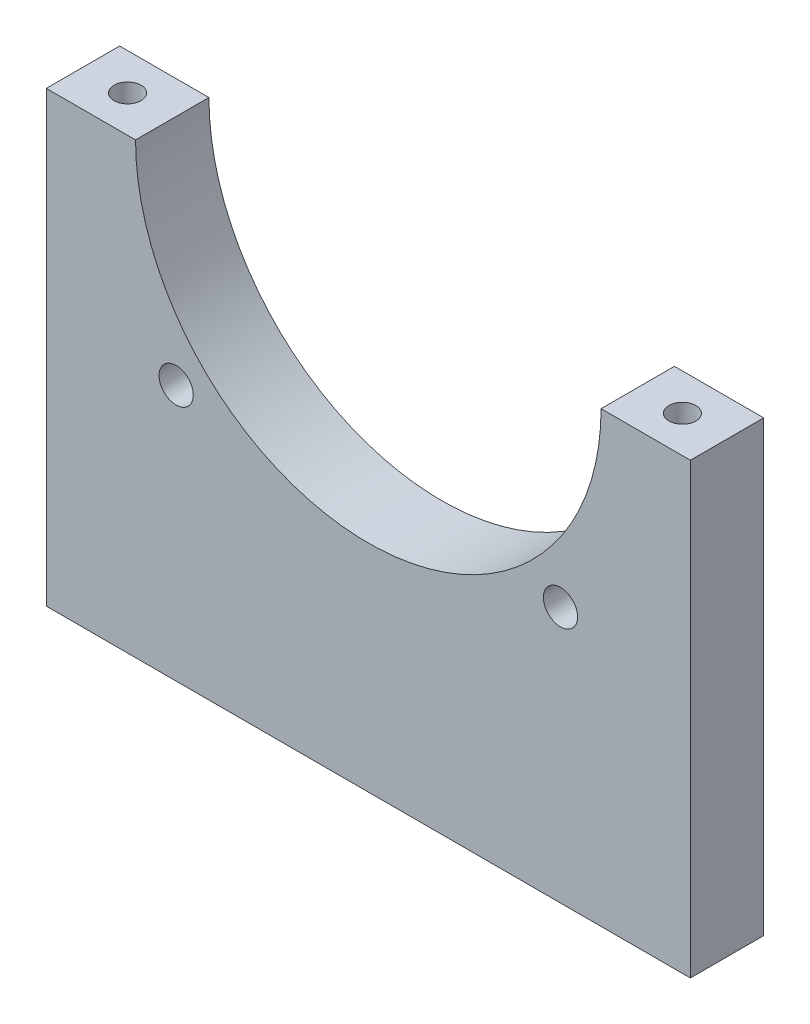
ISO-10303-21;
HEADER;
FILE_DESCRIPTION(('STEP AP214'),'2;1');
FILE_NAME('part.step','',(''),(''),'','','');
FILE_SCHEMA(('AUTOMOTIVE_DESIGN { 1 0 10303 214 1 1 1 1 }'));
ENDSEC;
DATA;
#1=APPLICATION_CONTEXT('core data for automotive mechanical design processes');
#2=APPLICATION_PROTOCOL_DEFINITION('international standard','automotive_design',2000,#1);
#3=PRODUCT_CONTEXT('',#1,'mechanical');
#4=PRODUCT('Part','Part','',(#3));
#5=PRODUCT_RELATED_PRODUCT_CATEGORY('part','',(#4));
#6=PRODUCT_DEFINITION_FORMATION('','',#4);
#7=PRODUCT_DEFINITION_CONTEXT('part definition',#1,'design');
#8=PRODUCT_DEFINITION('design','',#6,#7);
#9=PRODUCT_DEFINITION_SHAPE('','',#8);
#10=(LENGTH_UNIT() NAMED_UNIT(*) SI_UNIT(.MILLI.,.METRE.));
#11=(NAMED_UNIT(*) PLANE_ANGLE_UNIT() SI_UNIT($,.RADIAN.));
#12=(NAMED_UNIT(*) SI_UNIT($,.STERADIAN.) SOLID_ANGLE_UNIT());
#13=UNCERTAINTY_MEASURE_WITH_UNIT(LENGTH_MEASURE(1.E-05),#10,'distance_accuracy_value','');
#14=(GEOMETRIC_REPRESENTATION_CONTEXT(3) GLOBAL_UNCERTAINTY_ASSIGNED_CONTEXT((#13)) GLOBAL_UNIT_ASSIGNED_CONTEXT((#10,
#11,#12)) REPRESENTATION_CONTEXT('',''));
#15=CARTESIAN_POINT('',(0.,0.,0.));
#16=DIRECTION('',(0.,0.,1.));
#17=DIRECTION('',(1.,0.,0.));
#18=AXIS2_PLACEMENT_3D('',#15,#16,#17);
#19=CARTESIAN_POINT('',(0.,-35.,-4.5));
#20=DIRECTION('',(0.,-1.,0.));
#21=DIRECTION('',(0.,0.,-1.));
#22=AXIS2_PLACEMENT_3D('',#19,#20,#21);
#23=PLANE('',#22);
#24=CARTESIAN_POINT('',(-34.5,-35.,-4.5));
#25=DIRECTION('',(0.,-1.,0.));
#26=DIRECTION('',(1.,0.,0.));
#27=AXIS2_PLACEMENT_3D('',#24,#25,#26);
#28=CIRCLE('',#27,1.65);
#29=CARTESIAN_POINT('',(-32.85,-35.,-4.5));
#30=VERTEX_POINT('',#29);
#31=EDGE_CURVE('E11',#30,#30,#28,.T.);
#32=ORIENTED_EDGE('',*,*,#31,.T.);
#33=EDGE_LOOP('',(#32));
#34=FACE_BOUND('',#33,.T.);
#35=ADVANCED_FACE('F16',(#34),#23,.T.);
#36=CARTESIAN_POINT('',(-34.5,-35.,-4.5));
#37=DIRECTION('',(0.,-1.,0.));
#38=DIRECTION('',(1.,0.,0.));
#39=AXIS2_PLACEMENT_3D('',#36,#37,#38);
#40=CYLINDRICAL_SURFACE('',#39,1.65);
#41=CARTESIAN_POINT('',(-34.5,-55.,-4.5));
#42=DIRECTION('',(0.,-1.,0.));
#43=DIRECTION('',(1.,0.,0.));
#44=AXIS2_PLACEMENT_3D('',#41,#42,#43);
#45=CIRCLE('',#44,1.65);
#46=CARTESIAN_POINT('',(-32.85,-55.,-4.5));
#47=VERTEX_POINT('',#46);
#48=EDGE_CURVE('E145',#47,#47,#45,.T.);
#49=ORIENTED_EDGE('',*,*,#48,.T.);
#50=EDGE_LOOP('',(#49));
#51=FACE_BOUND('',#50,.T.);
#52=ORIENTED_EDGE('',*,*,#31,.F.);
#53=EDGE_LOOP('',(#52));
#54=FACE_BOUND('',#53,.T.);
#55=ADVANCED_FACE('F269',(#51,#54),#40,.F.);
#56=CARTESIAN_POINT('',(0.,-35.,-4.5));
#57=DIRECTION('',(0.,-1.,0.));
#58=DIRECTION('',(0.,0.,-1.));
#59=AXIS2_PLACEMENT_3D('',#56,#57,#58);
#60=PLANE('',#59);
#61=CARTESIAN_POINT('',(19.5,-35.,-4.5));
#62=DIRECTION('',(0.,-1.,0.));
#63=DIRECTION('',(1.,0.,0.));
#64=AXIS2_PLACEMENT_3D('',#61,#62,#63);
#65=CIRCLE('',#64,1.65);
#66=CARTESIAN_POINT('',(21.15,-35.,-4.5));
#67=VERTEX_POINT('',#66);
#68=EDGE_CURVE('E20',#67,#67,#65,.T.);
#69=ORIENTED_EDGE('',*,*,#68,.T.);
#70=EDGE_LOOP('',(#69));
#71=FACE_BOUND('',#70,.T.);
#72=ADVANCED_FACE('F273',(#71),#60,.T.);
#73=CARTESIAN_POINT('',(19.5,-35.,-4.5));
#74=DIRECTION('',(0.,-1.,0.));
#75=DIRECTION('',(1.,0.,0.));
#76=AXIS2_PLACEMENT_3D('',#73,#74,#75);
#77=CYLINDRICAL_SURFACE('',#76,1.65);
#78=CARTESIAN_POINT('',(19.5,-55.,-4.5));
#79=DIRECTION('',(0.,-1.,0.));
#80=DIRECTION('',(1.,0.,0.));
#81=AXIS2_PLACEMENT_3D('',#78,#79,#80);
#82=CIRCLE('',#81,1.65);
#83=CARTESIAN_POINT('',(21.15,-55.,-4.5));
#84=VERTEX_POINT('',#83);
#85=EDGE_CURVE('E140',#84,#84,#82,.T.);
#86=ORIENTED_EDGE('',*,*,#85,.T.);
#87=EDGE_LOOP('',(#86));
#88=FACE_BOUND('',#87,.T.);
#89=ORIENTED_EDGE('',*,*,#68,.F.);
#90=EDGE_LOOP('',(#89));
#91=FACE_BOUND('',#90,.T.);
#92=ADVANCED_FACE('F18',(#88,#91),#77,.F.);
#93=CARTESIAN_POINT('',(0.,-35.,-4.5));
#94=DIRECTION('',(0.,-1.,0.));
#95=DIRECTION('',(0.,0.,-1.));
#96=AXIS2_PLACEMENT_3D('',#93,#94,#95);
#97=PLANE('',#96);
#98=CARTESIAN_POINT('',(-11.5,-35.,-4.5));
#99=DIRECTION('',(0.,-1.,0.));
#100=DIRECTION('',(1.,0.,0.));
#101=AXIS2_PLACEMENT_3D('',#98,#99,#100);
#102=CIRCLE('',#101,1.65);
#103=CARTESIAN_POINT('',(-9.85,-35.,-4.5));
#104=VERTEX_POINT('',#103);
#105=EDGE_CURVE('E224',#104,#104,#102,.T.);
#106=ORIENTED_EDGE('',*,*,#105,.T.);
#107=EDGE_LOOP('',(#106));
#108=FACE_BOUND('',#107,.T.);
#109=ADVANCED_FACE('F453',(#108),#97,.T.);
#110=CARTESIAN_POINT('',(-11.5,-35.,-4.5));
#111=DIRECTION('',(0.,-1.,0.));
#112=DIRECTION('',(1.,0.,0.));
#113=AXIS2_PLACEMENT_3D('',#110,#111,#112);
#114=CYLINDRICAL_SURFACE('',#113,1.65);
#115=CARTESIAN_POINT('',(-11.5,-55.,-4.5));
#116=DIRECTION('',(0.,-1.,0.));
#117=DIRECTION('',(1.,0.,0.));
#118=AXIS2_PLACEMENT_3D('',#115,#116,#117);
#119=CIRCLE('',#118,1.65);
#120=CARTESIAN_POINT('',(-9.85,-55.,-4.5));
#121=VERTEX_POINT('',#120);
#122=EDGE_CURVE('E144',#121,#121,#119,.T.);
#123=ORIENTED_EDGE('',*,*,#122,.T.);
#124=EDGE_LOOP('',(#123));
#125=FACE_BOUND('',#124,.T.);
#126=ORIENTED_EDGE('',*,*,#105,.F.);
#127=EDGE_LOOP('',(#126));
#128=FACE_BOUND('',#127,.T.);
#129=ADVANCED_FACE('F444',(#125,#128),#114,.F.);
#130=CARTESIAN_POINT('',(0.,-20.,-4.5));
#131=DIRECTION('',(0.,-1.,0.));
#132=DIRECTION('',(0.,0.,-1.));
#133=AXIS2_PLACEMENT_3D('',#130,#131,#132);
#134=PLANE('',#133);
#135=CARTESIAN_POINT('',(34.025,-20.,-4.5));
#136=DIRECTION('',(0.,-1.,0.));
#137=DIRECTION('',(0.,0.,-1.));
#138=AXIS2_PLACEMENT_3D('',#135,#136,#137);
#139=CIRCLE('',#138,1.65);
#140=CARTESIAN_POINT('',(34.025,-20.,-6.15));
#141=VERTEX_POINT('',#140);
#142=EDGE_CURVE('E228',#141,#141,#139,.T.);
#143=ORIENTED_EDGE('',*,*,#142,.F.);
#144=EDGE_LOOP('',(#143));
#145=FACE_BOUND('',#144,.T.);
#146=ADVANCED_FACE('F417',(#145),#134,.F.);
#147=CARTESIAN_POINT('',(34.025,-20.,-4.5));
#148=DIRECTION('',(0.,1.,0.));
#149=DIRECTION('',(0.,0.,1.));
#150=AXIS2_PLACEMENT_3D('',#147,#148,#149);
#151=CYLINDRICAL_SURFACE('',#150,1.65);
#152=CARTESIAN_POINT('',(34.025,0.,-4.5));
#153=DIRECTION('',(0.,-1.,0.));
#154=DIRECTION('',(0.,0.,-1.));
#155=AXIS2_PLACEMENT_3D('',#152,#153,#154);
#156=CIRCLE('',#155,1.65);
#157=CARTESIAN_POINT('',(34.025,0.,-6.15));
#158=VERTEX_POINT('',#157);
#159=EDGE_CURVE('E196',#158,#158,#156,.T.);
#160=ORIENTED_EDGE('',*,*,#159,.F.);
#161=EDGE_LOOP('',(#160));
#162=FACE_BOUND('',#161,.T.);
#163=ORIENTED_EDGE('',*,*,#142,.T.);
#164=EDGE_LOOP('',(#163));
#165=FACE_BOUND('',#164,.T.);
#166=ADVANCED_FACE('F412',(#162,#165),#151,.F.);
#167=CARTESIAN_POINT('',(0.,-20.,-4.5));
#168=DIRECTION('',(0.,-1.,0.));
#169=DIRECTION('',(0.,0.,-1.));
#170=AXIS2_PLACEMENT_3D('',#167,#168,#169);
#171=PLANE('',#170);
#172=CARTESIAN_POINT('',(-34.025,-20.,-4.5));
#173=DIRECTION('',(0.,-1.,0.));
#174=DIRECTION('',(0.,0.,-1.));
#175=AXIS2_PLACEMENT_3D('',#172,#173,#174);
#176=CIRCLE('',#175,1.65);
#177=CARTESIAN_POINT('',(-34.025,-20.,-6.15));
#178=VERTEX_POINT('',#177);
#179=EDGE_CURVE('E173',#178,#178,#176,.T.);
#180=ORIENTED_EDGE('',*,*,#179,.F.);
#181=EDGE_LOOP('',(#180));
#182=FACE_BOUND('',#181,.T.);
#183=ADVANCED_FACE('F281',(#182),#171,.F.);
#184=CARTESIAN_POINT('',(-34.025,-20.,-4.5));
#185=DIRECTION('',(0.,1.,0.));
#186=DIRECTION('',(0.,0.,1.));
#187=AXIS2_PLACEMENT_3D('',#184,#185,#186);
#188=CYLINDRICAL_SURFACE('',#187,1.65);
#189=CARTESIAN_POINT('',(-34.025,0.,-4.5));
#190=DIRECTION('',(0.,-1.,0.));
#191=DIRECTION('',(0.,0.,-1.));
#192=AXIS2_PLACEMENT_3D('',#189,#190,#191);
#193=CIRCLE('',#192,1.65);
#194=CARTESIAN_POINT('',(-34.025,0.,-6.15));
#195=VERTEX_POINT('',#194);
#196=EDGE_CURVE('E179',#195,#195,#193,.T.);
#197=ORIENTED_EDGE('',*,*,#196,.F.);
#198=EDGE_LOOP('',(#197));
#199=FACE_BOUND('',#198,.T.);
#200=ORIENTED_EDGE('',*,*,#179,.T.);
#201=EDGE_LOOP('',(#200));
#202=FACE_BOUND('',#201,.T.);
#203=ADVANCED_FACE('F278',(#199,#202),#188,.F.);
#204=CARTESIAN_POINT('',(0.,-12.25,0.));
#205=DIRECTION('',(0.,0.,1.));
#206=DIRECTION('',(1.,0.,0.));
#207=AXIS2_PLACEMENT_3D('',#204,#205,#206);
#208=PLANE('',#207);
#209=DIRECTION('',(-1.,0.,0.));
#210=VECTOR('',#209,1.);
#211=CARTESIAN_POINT('',(0.,-55.,0.));
#212=LINE('',#211,#210);
#213=CARTESIAN_POINT('',(39.5,-55.,0.));
#214=VERTEX_POINT('',#213);
#215=CARTESIAN_POINT('',(-39.5,-55.,0.));
#216=VERTEX_POINT('',#215);
#217=EDGE_CURVE('E152',#214,#216,#212,.T.);
#218=ORIENTED_EDGE('',*,*,#217,.F.);
#219=DIRECTION('',(0.,1.,0.));
#220=VECTOR('',#219,1.);
#221=CARTESIAN_POINT('',(39.5,-27.5,0.));
#222=LINE('',#221,#220);
#223=CARTESIAN_POINT('',(39.5,0.,0.));
#224=VERTEX_POINT('',#223);
#225=EDGE_CURVE('E186',#214,#224,#222,.T.);
#226=ORIENTED_EDGE('',*,*,#225,.T.);
#227=DIRECTION('',(-1.,0.,0.));
#228=VECTOR('',#227,1.);
#229=CARTESIAN_POINT('',(34.025,0.,0.));
#230=LINE('',#229,#228);
#231=CARTESIAN_POINT('',(28.55,0.,0.));
#232=VERTEX_POINT('',#231);
#233=EDGE_CURVE('E160',#224,#232,#230,.T.);
#234=ORIENTED_EDGE('',*,*,#233,.T.);
#235=CARTESIAN_POINT('',(0.,0.,0.));
#236=DIRECTION('',(0.,0.,1.));
#237=DIRECTION('',(1.,0.,0.));
#238=AXIS2_PLACEMENT_3D('',#235,#236,#237);
#239=CIRCLE('',#238,28.55);
#240=CARTESIAN_POINT('',(-28.55,0.,0.));
#241=VERTEX_POINT('',#240);
#242=EDGE_CURVE('E205',#241,#232,#239,.T.);
#243=ORIENTED_EDGE('',*,*,#242,.F.);
#244=DIRECTION('',(1.,0.,0.));
#245=VECTOR('',#244,1.);
#246=CARTESIAN_POINT('',(-34.025,0.,0.));
#247=LINE('',#246,#245);
#248=CARTESIAN_POINT('',(-39.5,0.,0.));
#249=VERTEX_POINT('',#248);
#250=EDGE_CURVE('E202',#249,#241,#247,.T.);
#251=ORIENTED_EDGE('',*,*,#250,.F.);
#252=DIRECTION('',(0.,-1.,0.));
#253=VECTOR('',#252,1.);
#254=CARTESIAN_POINT('',(-39.5,-27.5,0.));
#255=LINE('',#254,#253);
#256=EDGE_CURVE('E174',#249,#216,#255,.T.);
#257=ORIENTED_EDGE('',*,*,#256,.T.);
#258=EDGE_LOOP('',(#218,#226,#234,#243,#251,#257));
#259=FACE_BOUND('',#258,.T.);
#260=CARTESIAN_POINT('',(-23.57,-23.57,0.));
#261=DIRECTION('',(0.,0.,1.));
#262=DIRECTION('',(1.,0.,0.));
#263=AXIS2_PLACEMENT_3D('',#260,#261,#262);
#264=CIRCLE('',#263,2.1);
#265=CARTESIAN_POINT('',(-21.47,-23.57,0.));
#266=VERTEX_POINT('',#265);
#267=EDGE_CURVE('E175',#266,#266,#264,.T.);
#268=ORIENTED_EDGE('',*,*,#267,.F.);
#269=EDGE_LOOP('',(#268));
#270=FACE_BOUND('',#269,.T.);
#271=CARTESIAN_POINT('',(23.57,-23.57,0.));
#272=DIRECTION('',(0.,0.,1.));
#273=DIRECTION('',(1.,0.,0.));
#274=AXIS2_PLACEMENT_3D('',#271,#272,#273);
#275=CIRCLE('',#274,2.1);
#276=CARTESIAN_POINT('',(25.67,-23.57,0.));
#277=VERTEX_POINT('',#276);
#278=EDGE_CURVE('E122',#277,#277,#275,.T.);
#279=ORIENTED_EDGE('',*,*,#278,.F.);
#280=EDGE_LOOP('',(#279));
#281=FACE_BOUND('',#280,.T.);
#282=ADVANCED_FACE('F280',(#259,#270,#281),#208,.T.);
#283=CARTESIAN_POINT('',(0.,-12.25,-9.));
#284=DIRECTION('',(0.,0.,1.));
#285=DIRECTION('',(1.,0.,0.));
#286=AXIS2_PLACEMENT_3D('',#283,#284,#285);
#287=PLANE('',#286);
#288=DIRECTION('',(-1.,0.,0.));
#289=VECTOR('',#288,1.);
#290=CARTESIAN_POINT('',(0.,-55.,-9.));
#291=LINE('',#290,#289);
#292=CARTESIAN_POINT('',(39.5,-55.,-9.));
#293=VERTEX_POINT('',#292);
#294=CARTESIAN_POINT('',(-39.5,-55.,-9.));
#295=VERTEX_POINT('',#294);
#296=EDGE_CURVE('E165',#293,#295,#291,.T.);
#297=ORIENTED_EDGE('',*,*,#296,.T.);
#298=DIRECTION('',(0.,-1.,0.));
#299=VECTOR('',#298,1.);
#300=CARTESIAN_POINT('',(-39.5,-27.5,-9.));
#301=LINE('',#300,#299);
#302=CARTESIAN_POINT('',(-39.5,0.,-9.));
#303=VERTEX_POINT('',#302);
#304=EDGE_CURVE('E170',#303,#295,#301,.T.);
#305=ORIENTED_EDGE('',*,*,#304,.F.);
#306=DIRECTION('',(1.,0.,0.));
#307=VECTOR('',#306,1.);
#308=CARTESIAN_POINT('',(-34.025,0.,-9.));
#309=LINE('',#308,#307);
#310=CARTESIAN_POINT('',(-28.55,0.,-9.));
#311=VERTEX_POINT('',#310);
#312=EDGE_CURVE('E199',#303,#311,#309,.T.);
#313=ORIENTED_EDGE('',*,*,#312,.T.);
#314=CARTESIAN_POINT('',(0.,0.,-9.));
#315=DIRECTION('',(0.,0.,1.));
#316=DIRECTION('',(1.,0.,0.));
#317=AXIS2_PLACEMENT_3D('',#314,#315,#316);
#318=CIRCLE('',#317,28.55);
#319=CARTESIAN_POINT('',(28.55,0.,-9.));
#320=VERTEX_POINT('',#319);
#321=EDGE_CURVE('E211',#311,#320,#318,.T.);
#322=ORIENTED_EDGE('',*,*,#321,.T.);
#323=DIRECTION('',(-1.,0.,0.));
#324=VECTOR('',#323,1.);
#325=CARTESIAN_POINT('',(34.025,0.,-9.));
#326=LINE('',#325,#324);
#327=CARTESIAN_POINT('',(39.5,0.,-9.));
#328=VERTEX_POINT('',#327);
#329=EDGE_CURVE('E163',#328,#320,#326,.T.);
#330=ORIENTED_EDGE('',*,*,#329,.F.);
#331=DIRECTION('',(0.,1.,0.));
#332=VECTOR('',#331,1.);
#333=CARTESIAN_POINT('',(39.5,-27.5,-9.));
#334=LINE('',#333,#332);
#335=EDGE_CURVE('E182',#293,#328,#334,.T.);
#336=ORIENTED_EDGE('',*,*,#335,.F.);
#337=EDGE_LOOP('',(#297,#305,#313,#322,#330,#336));
#338=FACE_BOUND('',#337,.T.);
#339=CARTESIAN_POINT('',(-23.57,-23.57,-9.));
#340=DIRECTION('',(0.,0.,1.));
#341=DIRECTION('',(1.,0.,0.));
#342=AXIS2_PLACEMENT_3D('',#339,#340,#341);
#343=CIRCLE('',#342,2.1);
#344=CARTESIAN_POINT('',(-21.47,-23.57,-9.));
#345=VERTEX_POINT('',#344);
#346=EDGE_CURVE('E178',#345,#345,#343,.T.);
#347=ORIENTED_EDGE('',*,*,#346,.T.);
#348=EDGE_LOOP('',(#347));
#349=FACE_BOUND('',#348,.T.);
#350=CARTESIAN_POINT('',(23.57,-23.57,-9.));
#351=DIRECTION('',(0.,0.,1.));
#352=DIRECTION('',(1.,0.,0.));
#353=AXIS2_PLACEMENT_3D('',#350,#351,#352);
#354=CIRCLE('',#353,2.1);
#355=CARTESIAN_POINT('',(25.67,-23.57,-9.));
#356=VERTEX_POINT('',#355);
#357=EDGE_CURVE('E131',#356,#356,#354,.T.);
#358=ORIENTED_EDGE('',*,*,#357,.T.);
#359=EDGE_LOOP('',(#358));
#360=FACE_BOUND('',#359,.T.);
#361=ADVANCED_FACE('F249',(#338,#349,#360),#287,.F.);
#362=CARTESIAN_POINT('',(-39.5,-27.5,-9.));
#363=DIRECTION('',(-1.,0.,0.));
#364=DIRECTION('',(0.,0.,1.));
#365=AXIS2_PLACEMENT_3D('',#362,#363,#364);
#366=PLANE('',#365);
#367=ORIENTED_EDGE('',*,*,#256,.F.);
#368=DIRECTION('',(0.,0.,1.));
#369=VECTOR('',#368,1.);
#370=CARTESIAN_POINT('',(-39.5,0.,-9.));
#371=LINE('',#370,#369);
#372=EDGE_CURVE('E158',#303,#249,#371,.T.);
#373=ORIENTED_EDGE('',*,*,#372,.F.);
#374=ORIENTED_EDGE('',*,*,#304,.T.);
#375=DIRECTION('',(0.,0.,1.));
#376=VECTOR('',#375,1.);
#377=CARTESIAN_POINT('',(-39.5,-55.,-9.));
#378=LINE('',#377,#376);
#379=EDGE_CURVE('E169',#295,#216,#378,.T.);
#380=ORIENTED_EDGE('',*,*,#379,.T.);
#381=EDGE_LOOP('',(#367,#373,#374,#380));
#382=FACE_BOUND('',#381,.T.);
#383=ADVANCED_FACE('F264',(#382),#366,.T.);
#384=CARTESIAN_POINT('',(23.57,-23.57,-9.));
#385=DIRECTION('',(0.,0.,1.));
#386=DIRECTION('',(1.,0.,0.));
#387=AXIS2_PLACEMENT_3D('',#384,#385,#386);
#388=CYLINDRICAL_SURFACE('',#387,2.1);
#389=ORIENTED_EDGE('',*,*,#278,.T.);
#390=EDGE_LOOP('',(#389));
#391=FACE_BOUND('',#390,.T.);
#392=ORIENTED_EDGE('',*,*,#357,.F.);
#393=EDGE_LOOP('',(#392));
#394=FACE_BOUND('',#393,.T.);
#395=ADVANCED_FACE('F254',(#391,#394),#388,.F.);
#396=CARTESIAN_POINT('',(-23.57,-23.57,-9.));
#397=DIRECTION('',(0.,0.,1.));
#398=DIRECTION('',(1.,0.,0.));
#399=AXIS2_PLACEMENT_3D('',#396,#397,#398);
#400=CYLINDRICAL_SURFACE('',#399,2.1);
#401=ORIENTED_EDGE('',*,*,#267,.T.);
#402=EDGE_LOOP('',(#401));
#403=FACE_BOUND('',#402,.T.);
#404=ORIENTED_EDGE('',*,*,#346,.F.);
#405=EDGE_LOOP('',(#404));
#406=FACE_BOUND('',#405,.T.);
#407=ADVANCED_FACE('F251',(#403,#406),#400,.F.);
#408=CARTESIAN_POINT('',(-34.025,0.,-9.));
#409=DIRECTION('',(0.,-1.,0.));
#410=DIRECTION('',(0.,0.,-1.));
#411=AXIS2_PLACEMENT_3D('',#408,#409,#410);
#412=PLANE('',#411);
#413=ORIENTED_EDGE('',*,*,#196,.T.);
#414=EDGE_LOOP('',(#413));
#415=FACE_BOUND('',#414,.T.);
#416=ORIENTED_EDGE('',*,*,#250,.T.);
#417=DIRECTION('',(0.,0.,1.));
#418=VECTOR('',#417,1.);
#419=CARTESIAN_POINT('',(-28.55,0.,-9.));
#420=LINE('',#419,#418);
#421=EDGE_CURVE('E220',#311,#241,#420,.T.);
#422=ORIENTED_EDGE('',*,*,#421,.F.);
#423=ORIENTED_EDGE('',*,*,#312,.F.);
#424=ORIENTED_EDGE('',*,*,#372,.T.);
#425=EDGE_LOOP('',(#416,#422,#423,#424));
#426=FACE_BOUND('',#425,.T.);
#427=ADVANCED_FACE('F253',(#415,#426),#412,.F.);
#428=CARTESIAN_POINT('',(0.,0.,-9.));
#429=DIRECTION('',(0.,0.,1.));
#430=DIRECTION('',(1.,0.,0.));
#431=AXIS2_PLACEMENT_3D('',#428,#429,#430);
#432=CYLINDRICAL_SURFACE('',#431,28.55);
#433=ORIENTED_EDGE('',*,*,#242,.T.);
#434=DIRECTION('',(0.,0.,1.));
#435=VECTOR('',#434,1.);
#436=CARTESIAN_POINT('',(28.55,0.,-9.));
#437=LINE('',#436,#435);
#438=EDGE_CURVE('E192',#320,#232,#437,.T.);
#439=ORIENTED_EDGE('',*,*,#438,.F.);
#440=ORIENTED_EDGE('',*,*,#321,.F.);
#441=ORIENTED_EDGE('',*,*,#421,.T.);
#442=EDGE_LOOP('',(#433,#439,#440,#441));
#443=FACE_BOUND('',#442,.T.);
#444=ADVANCED_FACE('F261',(#443),#432,.F.);
#445=CARTESIAN_POINT('',(34.025,0.,-9.));
#446=DIRECTION('',(0.,1.,0.));
#447=DIRECTION('',(1.,0.,0.));
#448=AXIS2_PLACEMENT_3D('',#445,#446,#447);
#449=PLANE('',#448);
#450=ORIENTED_EDGE('',*,*,#159,.T.);
#451=EDGE_LOOP('',(#450));
#452=FACE_BOUND('',#451,.T.);
#453=ORIENTED_EDGE('',*,*,#233,.F.);
#454=DIRECTION('',(0.,0.,1.));
#455=VECTOR('',#454,1.);
#456=CARTESIAN_POINT('',(39.5,0.,-9.));
#457=LINE('',#456,#455);
#458=EDGE_CURVE('E164',#328,#224,#457,.T.);
#459=ORIENTED_EDGE('',*,*,#458,.F.);
#460=ORIENTED_EDGE('',*,*,#329,.T.);
#461=ORIENTED_EDGE('',*,*,#438,.T.);
#462=EDGE_LOOP('',(#453,#459,#460,#461));
#463=FACE_BOUND('',#462,.T.);
#464=ADVANCED_FACE('F287',(#452,#463),#449,.T.);
#465=CARTESIAN_POINT('',(39.5,-27.5,-9.));
#466=DIRECTION('',(1.,0.,0.));
#467=DIRECTION('',(0.,1.,0.));
#468=AXIS2_PLACEMENT_3D('',#465,#466,#467);
#469=PLANE('',#468);
#470=ORIENTED_EDGE('',*,*,#225,.F.);
#471=DIRECTION('',(0.,0.,1.));
#472=VECTOR('',#471,1.);
#473=CARTESIAN_POINT('',(39.5,-55.,-9.));
#474=LINE('',#473,#472);
#475=EDGE_CURVE('E168',#293,#214,#474,.T.);
#476=ORIENTED_EDGE('',*,*,#475,.F.);
#477=ORIENTED_EDGE('',*,*,#335,.T.);
#478=ORIENTED_EDGE('',*,*,#458,.T.);
#479=EDGE_LOOP('',(#470,#476,#477,#478));
#480=FACE_BOUND('',#479,.T.);
#481=ADVANCED_FACE('F284',(#480),#469,.T.);
#482=CARTESIAN_POINT('',(0.,-55.,-9.));
#483=DIRECTION('',(0.,1.,0.));
#484=DIRECTION('',(1.,0.,0.));
#485=AXIS2_PLACEMENT_3D('',#482,#483,#484);
#486=PLANE('',#485);
#487=ORIENTED_EDGE('',*,*,#217,.T.);
#488=ORIENTED_EDGE('',*,*,#379,.F.);
#489=ORIENTED_EDGE('',*,*,#296,.F.);
#490=ORIENTED_EDGE('',*,*,#475,.T.);
#491=EDGE_LOOP('',(#487,#488,#489,#490));
#492=FACE_BOUND('',#491,.T.);
#493=ORIENTED_EDGE('',*,*,#122,.F.);
#494=EDGE_LOOP('',(#493));
#495=FACE_BOUND('',#494,.T.);
#496=ORIENTED_EDGE('',*,*,#85,.F.);
#497=EDGE_LOOP('',(#496));
#498=FACE_BOUND('',#497,.T.);
#499=ORIENTED_EDGE('',*,*,#48,.F.);
#500=EDGE_LOOP('',(#499));
#501=FACE_BOUND('',#500,.T.);
#502=ADVANCED_FACE('F286',(#492,#495,#498,#501),#486,.F.);
#503=CLOSED_SHELL('',(#35,#55,#72,#92,#109,#129,#146,#166,#183,#203,#282,#361,#383,#395,#407,
#427,#444,#464,#481,#502));
#504=MANIFOLD_SOLID_BREP('B1',#503);
#505=ADVANCED_BREP_SHAPE_REPRESENTATION('',(#18,#504),#14);
#506=SHAPE_DEFINITION_REPRESENTATION(#9,#505);
ENDSEC;
END-ISO-10303-21;
